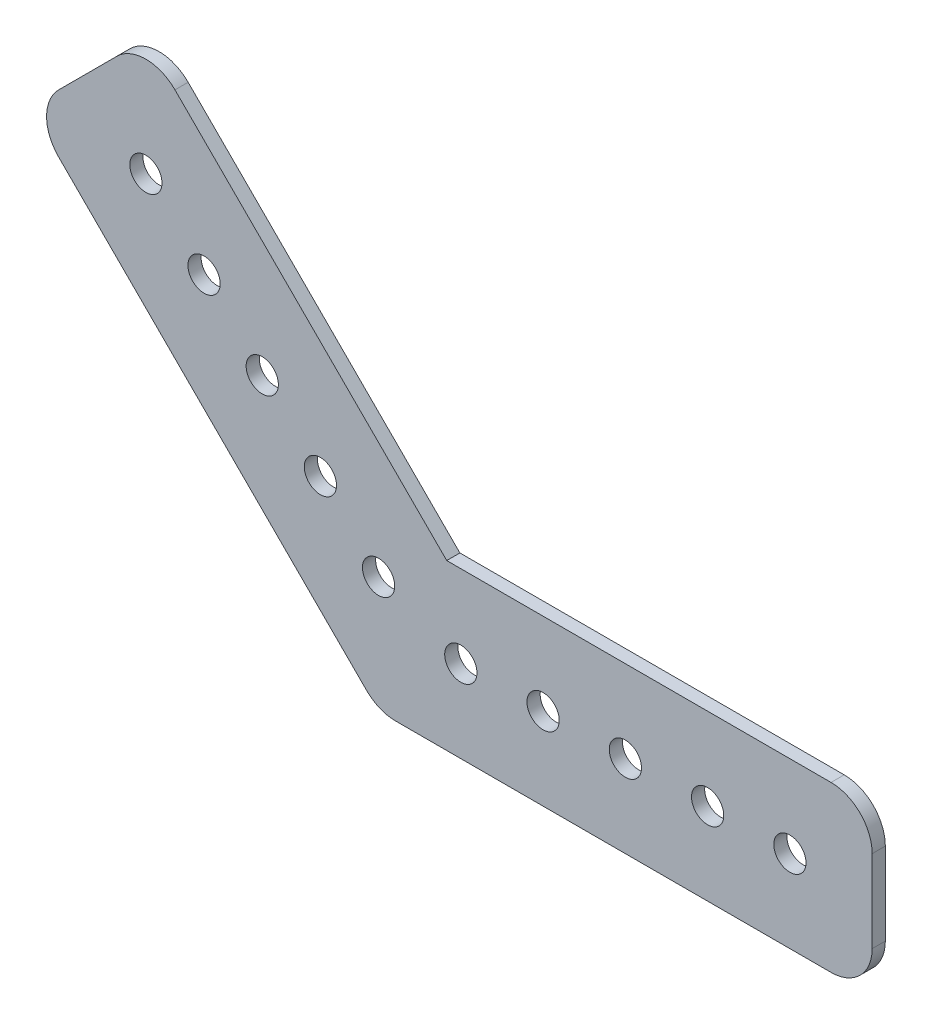
ISO-10303-21;
HEADER;
FILE_DESCRIPTION(('STEP AP214'),'2;1');
FILE_NAME('part.step','',(''),(''),'','','');
FILE_SCHEMA(('AUTOMOTIVE_DESIGN { 1 0 10303 214 1 1 1 1 }'));
ENDSEC;
DATA;
#1=APPLICATION_CONTEXT('core data for automotive mechanical design processes');
#2=APPLICATION_PROTOCOL_DEFINITION('international standard','automotive_design',2000,#1);
#3=PRODUCT_CONTEXT('',#1,'mechanical');
#4=PRODUCT('Part','Part','',(#3));
#5=PRODUCT_RELATED_PRODUCT_CATEGORY('part','',(#4));
#6=PRODUCT_DEFINITION_FORMATION('','',#4);
#7=PRODUCT_DEFINITION_CONTEXT('part definition',#1,'design');
#8=PRODUCT_DEFINITION('design','',#6,#7);
#9=PRODUCT_DEFINITION_SHAPE('','',#8);
#10=(LENGTH_UNIT() NAMED_UNIT(*) SI_UNIT(.MILLI.,.METRE.));
#11=(NAMED_UNIT(*) PLANE_ANGLE_UNIT() SI_UNIT($,.RADIAN.));
#12=(NAMED_UNIT(*) SI_UNIT($,.STERADIAN.) SOLID_ANGLE_UNIT());
#13=UNCERTAINTY_MEASURE_WITH_UNIT(LENGTH_MEASURE(1.E-05),#10,'distance_accuracy_value','');
#14=(GEOMETRIC_REPRESENTATION_CONTEXT(3) GLOBAL_UNCERTAINTY_ASSIGNED_CONTEXT((#13)) GLOBAL_UNIT_ASSIGNED_CONTEXT((#10,
#11,#12)) REPRESENTATION_CONTEXT('',''));
#15=CARTESIAN_POINT('',(0.,0.,0.));
#16=DIRECTION('',(0.,0.,1.));
#17=DIRECTION('',(1.,0.,0.));
#18=AXIS2_PLACEMENT_3D('',#15,#16,#17);
#19=CARTESIAN_POINT('',(-65.2629651905812,26.4043377690454,2.032));
#20=DIRECTION('',(0.,0.,1.));
#21=DIRECTION('',(1.,0.,0.));
#22=AXIS2_PLACEMENT_3D('',#19,#20,#21);
#23=PLANE('',#22);
#24=CARTESIAN_POINT('',(-112.121024484277,53.8815367264149,2.03200000000001));
#25=DIRECTION('',(0.,0.,1.));
#26=DIRECTION('',(1.,0.,0.));
#27=AXIS2_PLACEMENT_3D('',#24,#25,#26);
#28=CIRCLE('',#27,2.4892);
#29=CARTESIAN_POINT('',(-109.631824484277,53.8815367264149,2.03200000000001));
#30=VERTEX_POINT('',#29);
#31=EDGE_CURVE('E216',#30,#30,#28,.F.);
#32=ORIENTED_EDGE('',*,*,#31,.T.);
#33=EDGE_LOOP('',(#32));
#34=FACE_BOUND('',#33,.T.);
#35=CARTESIAN_POINT('',(-94.1605122421384,35.9210244842765,2.03200000000001));
#36=DIRECTION('',(0.,0.,1.));
#37=DIRECTION('',(1.,0.,0.));
#38=AXIS2_PLACEMENT_3D('',#35,#36,#37);
#39=CIRCLE('',#38,2.4892);
#40=CARTESIAN_POINT('',(-91.6713122421384,35.9210244842765,2.03200000000001));
#41=VERTEX_POINT('',#40);
#42=EDGE_CURVE('E213',#41,#41,#39,.F.);
#43=ORIENTED_EDGE('',*,*,#42,.T.);
#44=EDGE_LOOP('',(#43));
#45=FACE_BOUND('',#44,.T.);
#46=CARTESIAN_POINT('',(-76.2,17.9605122421383,2.03200000000001));
#47=DIRECTION('',(0.,0.,1.));
#48=DIRECTION('',(1.,0.,0.));
#49=AXIS2_PLACEMENT_3D('',#46,#47,#48);
#50=CIRCLE('',#49,2.4892);
#51=CARTESIAN_POINT('',(-73.7108,17.9605122421383,2.03200000000001));
#52=VERTEX_POINT('',#51);
#53=EDGE_CURVE('E210',#52,#52,#50,.F.);
#54=ORIENTED_EDGE('',*,*,#53,.T.);
#55=EDGE_LOOP('',(#54));
#56=FACE_BOUND('',#55,.T.);
#57=CARTESIAN_POINT('',(-25.4,12.7,2.03200000000001));
#58=DIRECTION('',(0.,0.,1.));
#59=DIRECTION('',(1.,0.,0.));
#60=AXIS2_PLACEMENT_3D('',#57,#58,#59);
#61=CIRCLE('',#60,2.4892);
#62=CARTESIAN_POINT('',(-22.9108,12.7,2.03200000000001));
#63=VERTEX_POINT('',#62);
#64=EDGE_CURVE('E207',#63,#63,#61,.F.);
#65=ORIENTED_EDGE('',*,*,#64,.T.);
#66=EDGE_LOOP('',(#65));
#67=FACE_BOUND('',#66,.T.);
#68=CARTESIAN_POINT('',(-50.8,12.7,2.03200000000001));
#69=DIRECTION('',(0.,0.,1.));
#70=DIRECTION('',(1.,0.,0.));
#71=AXIS2_PLACEMENT_3D('',#68,#69,#70);
#72=CIRCLE('',#71,2.4892);
#73=CARTESIAN_POINT('',(-48.3108,12.7,2.03200000000001));
#74=VERTEX_POINT('',#73);
#75=EDGE_CURVE('E204',#74,#74,#72,.F.);
#76=ORIENTED_EDGE('',*,*,#75,.T.);
#77=EDGE_LOOP('',(#76));
#78=FACE_BOUND('',#77,.T.);
#79=CARTESIAN_POINT('',(-63.5,12.7,2.03200000000001));
#80=DIRECTION('',(0.,0.,1.));
#81=DIRECTION('',(1.,0.,0.));
#82=AXIS2_PLACEMENT_3D('',#79,#80,#81);
#83=CIRCLE('',#82,2.4892);
#84=CARTESIAN_POINT('',(-61.0108,12.7,2.03200000000001));
#85=VERTEX_POINT('',#84);
#86=EDGE_CURVE('E201',#85,#85,#83,.F.);
#87=ORIENTED_EDGE('',*,*,#86,.T.);
#88=EDGE_LOOP('',(#87));
#89=FACE_BOUND('',#88,.T.);
#90=CARTESIAN_POINT('',(-38.1,12.7,2.03200000000001));
#91=DIRECTION('',(0.,0.,1.));
#92=DIRECTION('',(1.,0.,0.));
#93=AXIS2_PLACEMENT_3D('',#90,#91,#92);
#94=CIRCLE('',#93,2.4892);
#95=CARTESIAN_POINT('',(-35.6108,12.7,2.03200000000001));
#96=VERTEX_POINT('',#95);
#97=EDGE_CURVE('E198',#96,#96,#94,.F.);
#98=ORIENTED_EDGE('',*,*,#97,.T.);
#99=EDGE_LOOP('',(#98));
#100=FACE_BOUND('',#99,.T.);
#101=CARTESIAN_POINT('',(-12.7,12.7,2.03200000000001));
#102=DIRECTION('',(0.,0.,1.));
#103=DIRECTION('',(1.,0.,0.));
#104=AXIS2_PLACEMENT_3D('',#101,#102,#103);
#105=CIRCLE('',#104,2.4892);
#106=CARTESIAN_POINT('',(-10.2108,12.7,2.03200000000001));
#107=VERTEX_POINT('',#106);
#108=EDGE_CURVE('E195',#107,#107,#105,.F.);
#109=ORIENTED_EDGE('',*,*,#108,.T.);
#110=EDGE_LOOP('',(#109));
#111=FACE_BOUND('',#110,.T.);
#112=CARTESIAN_POINT('',(-85.1802561210693,26.9407683632074,2.03200000000001));
#113=DIRECTION('',(0.,0.,1.));
#114=DIRECTION('',(1.,0.,0.));
#115=AXIS2_PLACEMENT_3D('',#112,#113,#114);
#116=CIRCLE('',#115,2.4892);
#117=CARTESIAN_POINT('',(-82.6910561210693,26.9407683632074,2.03200000000001));
#118=VERTEX_POINT('',#117);
#119=EDGE_CURVE('E192',#118,#118,#116,.F.);
#120=ORIENTED_EDGE('',*,*,#119,.T.);
#121=EDGE_LOOP('',(#120));
#122=FACE_BOUND('',#121,.T.);
#123=CARTESIAN_POINT('',(-103.140768363207,44.9012806053458,2.03200000000001));
#124=DIRECTION('',(0.,0.,1.));
#125=DIRECTION('',(1.,0.,0.));
#126=AXIS2_PLACEMENT_3D('',#123,#124,#125);
#127=CIRCLE('',#126,2.4892);
#128=CARTESIAN_POINT('',(-100.651568363207,44.9012806053458,2.03200000000001));
#129=VERTEX_POINT('',#128);
#130=EDGE_CURVE('E189',#129,#129,#127,.F.);
#131=ORIENTED_EDGE('',*,*,#130,.T.);
#132=EDGE_LOOP('',(#131));
#133=FACE_BOUND('',#132,.T.);
#134=DIRECTION('',(-1.,0.,0.));
#135=VECTOR('',#134,1.);
#136=CARTESIAN_POINT('',(0.,25.4,2.032));
#137=LINE('',#136,#135);
#138=CARTESIAN_POINT('',(-65.6789755157235,25.4,2.032));
#139=VERTEX_POINT('',#138);
#140=CARTESIAN_POINT('',(-6.35,25.4,2.032));
#141=VERTEX_POINT('',#140);
#142=EDGE_CURVE('E125',#139,#141,#137,.F.);
#143=ORIENTED_EDGE('',*,*,#142,.F.);
#144=DIRECTION('',(-0.707106781186548,0.707106781186547,0.));
#145=VECTOR('',#144,1.);
#146=CARTESIAN_POINT('',(-65.6789755157235,25.4,2.032));
#147=LINE('',#146,#145);
#148=CARTESIAN_POINT('',(-107.630896423742,67.3519209080186,2.032));
#149=VERTEX_POINT('',#148);
#150=EDGE_CURVE('E121',#149,#139,#147,.F.);
#151=ORIENTED_EDGE('',*,*,#150,.F.);
#152=CARTESIAN_POINT('',(-112.121024484277,62.8617928474842,2.032));
#153=DIRECTION('',(0.,0.,1.));
#154=DIRECTION('',(1.,0.,0.));
#155=AXIS2_PLACEMENT_3D('',#152,#153,#154);
#156=CIRCLE('',#155,6.35);
#157=CARTESIAN_POINT('',(-116.611152544811,67.3519209080187,2.032));
#158=VERTEX_POINT('',#157);
#159=EDGE_CURVE('E108',#158,#149,#156,.F.);
#160=ORIENTED_EDGE('',*,*,#159,.F.);
#161=DIRECTION('',(-0.707106781186547,-0.707106781186548,0.));
#162=VECTOR('',#161,1.);
#163=CARTESIAN_POINT('',(-112.121024484277,71.8420489685532,2.032));
#164=LINE('',#163,#162);
#165=CARTESIAN_POINT('',(-125.59140866588,58.3716647869495,2.032));
#166=VERTEX_POINT('',#165);
#167=EDGE_CURVE('E104',#166,#158,#164,.F.);
#168=ORIENTED_EDGE('',*,*,#167,.F.);
#169=CARTESIAN_POINT('',(-121.101280605346,53.8815367264149,2.032));
#170=DIRECTION('',(0.,0.,1.));
#171=DIRECTION('',(1.,0.,0.));
#172=AXIS2_PLACEMENT_3D('',#169,#170,#171);
#173=CIRCLE('',#172,6.35);
#174=CARTESIAN_POINT('',(-125.59140866588,49.3914086658803,2.032));
#175=VERTEX_POINT('',#174);
#176=EDGE_CURVE('E18',#175,#166,#173,.F.);
#177=ORIENTED_EDGE('',*,*,#176,.F.);
#178=DIRECTION('',(0.707106781186548,-0.707106781186547,0.));
#179=VECTOR('',#178,1.);
#180=CARTESIAN_POINT('',(-130.081536726415,53.8815367264149,2.032));
#181=LINE('',#180,#179);
#182=CARTESIAN_POINT('',(-78.0598719394654,1.85987193946542,2.032));
#183=VERTEX_POINT('',#182);
#184=EDGE_CURVE('E117',#183,#175,#181,.F.);
#185=ORIENTED_EDGE('',*,*,#184,.F.);
#186=CARTESIAN_POINT('',(-73.5697438789309,6.35,2.032));
#187=DIRECTION('',(0.,0.,1.));
#188=DIRECTION('',(1.,0.,0.));
#189=AXIS2_PLACEMENT_3D('',#186,#187,#188);
#190=CIRCLE('',#189,6.35);
#191=CARTESIAN_POINT('',(-73.5697438789309,0.,2.032));
#192=VERTEX_POINT('',#191);
#193=EDGE_CURVE('E143',#192,#183,#190,.F.);
#194=ORIENTED_EDGE('',*,*,#193,.F.);
#195=DIRECTION('',(1.,0.,0.));
#196=VECTOR('',#195,1.);
#197=CARTESIAN_POINT('',(-76.2,0.,2.032));
#198=LINE('',#197,#196);
#199=CARTESIAN_POINT('',(-6.35,0.,2.032));
#200=VERTEX_POINT('',#199);
#201=EDGE_CURVE('E138',#200,#192,#198,.F.);
#202=ORIENTED_EDGE('',*,*,#201,.F.);
#203=CARTESIAN_POINT('',(-6.35,6.35,2.032));
#204=DIRECTION('',(0.,0.,1.));
#205=DIRECTION('',(1.,0.,0.));
#206=AXIS2_PLACEMENT_3D('',#203,#204,#205);
#207=CIRCLE('',#206,6.35);
#208=CARTESIAN_POINT('',(0.,6.35,2.032));
#209=VERTEX_POINT('',#208);
#210=EDGE_CURVE('E141',#209,#200,#207,.F.);
#211=ORIENTED_EDGE('',*,*,#210,.F.);
#212=DIRECTION('',(0.,1.,0.));
#213=VECTOR('',#212,1.);
#214=CARTESIAN_POINT('',(0.,0.,2.032));
#215=LINE('',#214,#213);
#216=CARTESIAN_POINT('',(0.,19.05,2.032));
#217=VERTEX_POINT('',#216);
#218=EDGE_CURVE('E133',#217,#209,#215,.F.);
#219=ORIENTED_EDGE('',*,*,#218,.F.);
#220=CARTESIAN_POINT('',(-6.35,19.05,2.032));
#221=DIRECTION('',(0.,0.,1.));
#222=DIRECTION('',(1.,0.,0.));
#223=AXIS2_PLACEMENT_3D('',#220,#221,#222);
#224=CIRCLE('',#223,6.35);
#225=EDGE_CURVE('E136',#141,#217,#224,.F.);
#226=ORIENTED_EDGE('',*,*,#225,.F.);
#227=EDGE_LOOP('',(#143,#151,#160,#168,#177,#185,#194,#202,#211,#219,#226));
#228=FACE_BOUND('',#227,.T.);
#229=ADVANCED_FACE('F15',(#34,#45,#56,#67,#78,#89,#100,#111,#122,#133,#228),#23,.T.);
#230=CARTESIAN_POINT('',(-112.121024484277,71.8420489685532,0.));
#231=DIRECTION('',(-0.707106781186548,0.707106781186547,0.));
#232=DIRECTION('',(-0.707106781186547,-0.707106781186548,0.));
#233=AXIS2_PLACEMENT_3D('',#230,#231,#232);
#234=PLANE('',#233);
#235=DIRECTION('',(0.,0.,1.));
#236=VECTOR('',#235,1.);
#237=CARTESIAN_POINT('',(-125.59140866588,58.3716647869494,0.));
#238=LINE('',#237,#236);
#239=CARTESIAN_POINT('',(-125.59140866588,58.3716647869495,0.));
#240=VERTEX_POINT('',#239);
#241=EDGE_CURVE('E101',#166,#240,#238,.F.);
#242=ORIENTED_EDGE('',*,*,#241,.F.);
#243=ORIENTED_EDGE('',*,*,#167,.T.);
#244=DIRECTION('',(0.,0.,1.));
#245=VECTOR('',#244,1.);
#246=CARTESIAN_POINT('',(-116.611152544811,67.3519209080188,0.));
#247=LINE('',#246,#245);
#248=CARTESIAN_POINT('',(-116.611152544811,67.3519209080187,0.));
#249=VERTEX_POINT('',#248);
#250=EDGE_CURVE('E219',#249,#158,#247,.T.);
#251=ORIENTED_EDGE('',*,*,#250,.F.);
#252=DIRECTION('',(-0.707106781186558,-0.707106781186537,0.));
#253=VECTOR('',#252,1.);
#254=CARTESIAN_POINT('',(-116.611152544811,67.3519209080186,0.));
#255=LINE('',#254,#253);
#256=EDGE_CURVE('E115',#249,#240,#255,.T.);
#257=ORIENTED_EDGE('',*,*,#256,.T.);
#258=EDGE_LOOP('',(#242,#243,#251,#257));
#259=FACE_BOUND('',#258,.T.);
#260=ADVANCED_FACE('F114',(#259),#234,.T.);
#261=CARTESIAN_POINT('',(-121.101280605346,53.8815367264149,0.));
#262=DIRECTION('',(0.,0.,1.));
#263=DIRECTION('',(1.,0.,0.));
#264=AXIS2_PLACEMENT_3D('',#261,#262,#263);
#265=CYLINDRICAL_SURFACE('',#264,6.35);
#266=CARTESIAN_POINT('',(-121.101280605346,53.8815367264149,0.));
#267=DIRECTION('',(0.,0.,1.));
#268=DIRECTION('',(1.,0.,0.));
#269=AXIS2_PLACEMENT_3D('',#266,#267,#268);
#270=CIRCLE('',#269,6.35);
#271=CARTESIAN_POINT('',(-125.59140866588,49.3914086658803,0.));
#272=VERTEX_POINT('',#271);
#273=EDGE_CURVE('E187',#240,#272,#270,.T.);
#274=ORIENTED_EDGE('',*,*,#273,.T.);
#275=DIRECTION('',(0.,0.,1.));
#276=VECTOR('',#275,1.);
#277=CARTESIAN_POINT('',(-125.59140866588,49.3914086658803,0.));
#278=LINE('',#277,#276);
#279=EDGE_CURVE('E103',#175,#272,#278,.F.);
#280=ORIENTED_EDGE('',*,*,#279,.F.);
#281=ORIENTED_EDGE('',*,*,#176,.T.);
#282=ORIENTED_EDGE('',*,*,#241,.T.);
#283=EDGE_LOOP('',(#274,#280,#281,#282));
#284=FACE_BOUND('',#283,.T.);
#285=ADVANCED_FACE('F99',(#284),#265,.T.);
#286=CARTESIAN_POINT('',(-130.081536726415,53.8815367264149,0.));
#287=DIRECTION('',(-0.707106781186547,-0.707106781186548,0.));
#288=DIRECTION('',(0.707106781186548,-0.707106781186547,0.));
#289=AXIS2_PLACEMENT_3D('',#286,#287,#288);
#290=PLANE('',#289);
#291=DIRECTION('',(0.,0.,1.));
#292=VECTOR('',#291,1.);
#293=CARTESIAN_POINT('',(-78.0598719394654,1.85987193946534,0.));
#294=LINE('',#293,#292);
#295=CARTESIAN_POINT('',(-78.0598719394654,1.85987193946541,0.));
#296=VERTEX_POINT('',#295);
#297=EDGE_CURVE('E224',#183,#296,#294,.F.);
#298=ORIENTED_EDGE('',*,*,#297,.F.);
#299=ORIENTED_EDGE('',*,*,#184,.T.);
#300=ORIENTED_EDGE('',*,*,#279,.T.);
#301=DIRECTION('',(0.70710678118655,-0.707106781186545,0.));
#302=VECTOR('',#301,1.);
#303=CARTESIAN_POINT('',(-125.59140866588,49.3914086658802,0.));
#304=LINE('',#303,#302);
#305=EDGE_CURVE('E186',#272,#296,#304,.T.);
#306=ORIENTED_EDGE('',*,*,#305,.T.);
#307=EDGE_LOOP('',(#298,#299,#300,#306));
#308=FACE_BOUND('',#307,.T.);
#309=ADVANCED_FACE('F284',(#308),#290,.T.);
#310=CARTESIAN_POINT('',(-73.5697438789309,6.35,0.));
#311=DIRECTION('',(0.,0.,1.));
#312=DIRECTION('',(1.,0.,0.));
#313=AXIS2_PLACEMENT_3D('',#310,#311,#312);
#314=CYLINDRICAL_SURFACE('',#313,6.35);
#315=CARTESIAN_POINT('',(-73.5697438789309,6.35,0.));
#316=DIRECTION('',(0.,0.,1.));
#317=DIRECTION('',(1.,0.,0.));
#318=AXIS2_PLACEMENT_3D('',#315,#316,#317);
#319=CIRCLE('',#318,6.35);
#320=CARTESIAN_POINT('',(-73.5697438789309,0.,0.));
#321=VERTEX_POINT('',#320);
#322=EDGE_CURVE('E183',#296,#321,#319,.T.);
#323=ORIENTED_EDGE('',*,*,#322,.T.);
#324=DIRECTION('',(0.,0.,1.));
#325=VECTOR('',#324,1.);
#326=CARTESIAN_POINT('',(-73.5697438789309,0.,0.));
#327=LINE('',#326,#325);
#328=EDGE_CURVE('E142',#192,#321,#327,.F.);
#329=ORIENTED_EDGE('',*,*,#328,.F.);
#330=ORIENTED_EDGE('',*,*,#193,.T.);
#331=ORIENTED_EDGE('',*,*,#297,.T.);
#332=EDGE_LOOP('',(#323,#329,#330,#331));
#333=FACE_BOUND('',#332,.T.);
#334=ADVANCED_FACE('F281',(#333),#314,.T.);
#335=CARTESIAN_POINT('',(-76.2,0.,0.));
#336=DIRECTION('',(0.,-1.,0.));
#337=DIRECTION('',(1.,0.,0.));
#338=AXIS2_PLACEMENT_3D('',#335,#336,#337);
#339=PLANE('',#338);
#340=DIRECTION('',(0.,0.,1.));
#341=VECTOR('',#340,1.);
#342=CARTESIAN_POINT('',(-6.35,0.,0.));
#343=LINE('',#342,#341);
#344=CARTESIAN_POINT('',(-6.35,0.,0.));
#345=VERTEX_POINT('',#344);
#346=EDGE_CURVE('E223',#200,#345,#343,.F.);
#347=ORIENTED_EDGE('',*,*,#346,.F.);
#348=ORIENTED_EDGE('',*,*,#201,.T.);
#349=ORIENTED_EDGE('',*,*,#328,.T.);
#350=DIRECTION('',(1.,0.,0.));
#351=VECTOR('',#350,1.);
#352=CARTESIAN_POINT('',(-65.2629651905812,0.,0.));
#353=LINE('',#352,#351);
#354=EDGE_CURVE('E182',#321,#345,#353,.T.);
#355=ORIENTED_EDGE('',*,*,#354,.T.);
#356=EDGE_LOOP('',(#347,#348,#349,#355));
#357=FACE_BOUND('',#356,.T.);
#358=ADVANCED_FACE('F280',(#357),#339,.T.);
#359=CARTESIAN_POINT('',(-6.35,6.35,0.));
#360=DIRECTION('',(0.,0.,1.));
#361=DIRECTION('',(1.,0.,0.));
#362=AXIS2_PLACEMENT_3D('',#359,#360,#361);
#363=CYLINDRICAL_SURFACE('',#362,6.35);
#364=CARTESIAN_POINT('',(-6.35,6.35,0.));
#365=DIRECTION('',(0.,0.,1.));
#366=DIRECTION('',(1.,0.,0.));
#367=AXIS2_PLACEMENT_3D('',#364,#365,#366);
#368=CIRCLE('',#367,6.35);
#369=CARTESIAN_POINT('',(0.,6.35,0.));
#370=VERTEX_POINT('',#369);
#371=EDGE_CURVE('E179',#345,#370,#368,.T.);
#372=ORIENTED_EDGE('',*,*,#371,.T.);
#373=DIRECTION('',(0.,0.,1.));
#374=VECTOR('',#373,1.);
#375=CARTESIAN_POINT('',(0.,6.35,0.));
#376=LINE('',#375,#374);
#377=EDGE_CURVE('E137',#209,#370,#376,.F.);
#378=ORIENTED_EDGE('',*,*,#377,.F.);
#379=ORIENTED_EDGE('',*,*,#210,.T.);
#380=ORIENTED_EDGE('',*,*,#346,.T.);
#381=EDGE_LOOP('',(#372,#378,#379,#380));
#382=FACE_BOUND('',#381,.T.);
#383=ADVANCED_FACE('F275',(#382),#363,.T.);
#384=CARTESIAN_POINT('',(0.,0.,0.));
#385=DIRECTION('',(1.,0.,0.));
#386=DIRECTION('',(0.,1.,0.));
#387=AXIS2_PLACEMENT_3D('',#384,#385,#386);
#388=PLANE('',#387);
#389=DIRECTION('',(0.,0.,1.));
#390=VECTOR('',#389,1.);
#391=CARTESIAN_POINT('',(0.,19.05,0.));
#392=LINE('',#391,#390);
#393=CARTESIAN_POINT('',(0.,19.05,0.));
#394=VERTEX_POINT('',#393);
#395=EDGE_CURVE('E222',#217,#394,#392,.F.);
#396=ORIENTED_EDGE('',*,*,#395,.F.);
#397=ORIENTED_EDGE('',*,*,#218,.T.);
#398=ORIENTED_EDGE('',*,*,#377,.T.);
#399=DIRECTION('',(0.,1.,0.));
#400=VECTOR('',#399,1.);
#401=CARTESIAN_POINT('',(0.,26.4043377690454,0.));
#402=LINE('',#401,#400);
#403=EDGE_CURVE('E178',#370,#394,#402,.T.);
#404=ORIENTED_EDGE('',*,*,#403,.T.);
#405=EDGE_LOOP('',(#396,#397,#398,#404));
#406=FACE_BOUND('',#405,.T.);
#407=ADVANCED_FACE('F272',(#406),#388,.T.);
#408=CARTESIAN_POINT('',(-6.35,19.05,0.));
#409=DIRECTION('',(0.,0.,1.));
#410=DIRECTION('',(1.,0.,0.));
#411=AXIS2_PLACEMENT_3D('',#408,#409,#410);
#412=CYLINDRICAL_SURFACE('',#411,6.35);
#413=CARTESIAN_POINT('',(-6.35,19.05,0.));
#414=DIRECTION('',(0.,0.,1.));
#415=DIRECTION('',(1.,0.,0.));
#416=AXIS2_PLACEMENT_3D('',#413,#414,#415);
#417=CIRCLE('',#416,6.35);
#418=CARTESIAN_POINT('',(-6.35,25.4,0.));
#419=VERTEX_POINT('',#418);
#420=EDGE_CURVE('E174',#394,#419,#417,.T.);
#421=ORIENTED_EDGE('',*,*,#420,.T.);
#422=DIRECTION('',(0.,0.,1.));
#423=VECTOR('',#422,1.);
#424=CARTESIAN_POINT('',(-6.35,25.4,0.));
#425=LINE('',#424,#423);
#426=EDGE_CURVE('E130',#141,#419,#425,.F.);
#427=ORIENTED_EDGE('',*,*,#426,.F.);
#428=ORIENTED_EDGE('',*,*,#225,.T.);
#429=ORIENTED_EDGE('',*,*,#395,.T.);
#430=EDGE_LOOP('',(#421,#427,#428,#429));
#431=FACE_BOUND('',#430,.T.);
#432=ADVANCED_FACE('F266',(#431),#412,.T.);
#433=CARTESIAN_POINT('',(0.,25.4,0.));
#434=DIRECTION('',(0.,1.,0.));
#435=DIRECTION('',(-1.,0.,0.));
#436=AXIS2_PLACEMENT_3D('',#433,#434,#435);
#437=PLANE('',#436);
#438=DIRECTION('',(0.,0.,1.));
#439=VECTOR('',#438,1.);
#440=CARTESIAN_POINT('',(-65.6789755157235,25.4,0.));
#441=LINE('',#440,#439);
#442=CARTESIAN_POINT('',(-65.6789755157235,25.4,0.));
#443=VERTEX_POINT('',#442);
#444=EDGE_CURVE('E124',#139,#443,#441,.F.);
#445=ORIENTED_EDGE('',*,*,#444,.F.);
#446=ORIENTED_EDGE('',*,*,#142,.T.);
#447=ORIENTED_EDGE('',*,*,#426,.T.);
#448=DIRECTION('',(1.,0.,0.));
#449=VECTOR('',#448,1.);
#450=CARTESIAN_POINT('',(-65.2629651905812,25.4,0.));
#451=LINE('',#450,#449);
#452=EDGE_CURVE('E177',#419,#443,#451,.F.);
#453=ORIENTED_EDGE('',*,*,#452,.T.);
#454=EDGE_LOOP('',(#445,#446,#447,#453));
#455=FACE_BOUND('',#454,.T.);
#456=ADVANCED_FACE('F263',(#455),#437,.T.);
#457=CARTESIAN_POINT('',(-65.6789755157235,25.4,0.));
#458=DIRECTION('',(0.707106781186547,0.707106781186548,0.));
#459=DIRECTION('',(-0.707106781186548,0.707106781186547,0.));
#460=AXIS2_PLACEMENT_3D('',#457,#458,#459);
#461=PLANE('',#460);
#462=ORIENTED_EDGE('',*,*,#444,.T.);
#463=DIRECTION('',(-0.707106781186547,0.707106781186548,0.));
#464=VECTOR('',#463,1.);
#465=CARTESIAN_POINT('',(-65.6789755157235,25.4,0.));
#466=LINE('',#465,#464);
#467=CARTESIAN_POINT('',(-107.630896423742,67.3519209080186,0.));
#468=VERTEX_POINT('',#467);
#469=EDGE_CURVE('E173',#443,#468,#466,.T.);
#470=ORIENTED_EDGE('',*,*,#469,.T.);
#471=DIRECTION('',(0.,0.,1.));
#472=VECTOR('',#471,1.);
#473=CARTESIAN_POINT('',(-107.630896423742,67.3519209080186,0.));
#474=LINE('',#473,#472);
#475=EDGE_CURVE('E33',#149,#468,#474,.F.);
#476=ORIENTED_EDGE('',*,*,#475,.F.);
#477=ORIENTED_EDGE('',*,*,#150,.T.);
#478=EDGE_LOOP('',(#462,#470,#476,#477));
#479=FACE_BOUND('',#478,.T.);
#480=ADVANCED_FACE('F256',(#479),#461,.T.);
#481=CARTESIAN_POINT('',(-112.121024484277,62.8617928474842,0.));
#482=DIRECTION('',(0.,0.,1.));
#483=DIRECTION('',(1.,0.,0.));
#484=AXIS2_PLACEMENT_3D('',#481,#482,#483);
#485=CYLINDRICAL_SURFACE('',#484,6.35);
#486=CARTESIAN_POINT('',(-112.121024484277,62.8617928474842,0.));
#487=DIRECTION('',(0.,0.,1.));
#488=DIRECTION('',(1.,0.,0.));
#489=AXIS2_PLACEMENT_3D('',#486,#487,#488);
#490=CIRCLE('',#489,6.35);
#491=EDGE_CURVE('E171',#468,#249,#490,.T.);
#492=ORIENTED_EDGE('',*,*,#491,.T.);
#493=ORIENTED_EDGE('',*,*,#250,.T.);
#494=ORIENTED_EDGE('',*,*,#159,.T.);
#495=ORIENTED_EDGE('',*,*,#475,.T.);
#496=EDGE_LOOP('',(#492,#493,#494,#495));
#497=FACE_BOUND('',#496,.T.);
#498=ADVANCED_FACE('F341',(#497),#485,.T.);
#499=CARTESIAN_POINT('',(-112.121024484277,53.8815367264149,148.615662771814));
#500=DIRECTION('',(0.,0.,1.));
#501=DIRECTION('',(1.,0.,0.));
#502=AXIS2_PLACEMENT_3D('',#499,#500,#501);
#503=CYLINDRICAL_SURFACE('',#502,2.4892);
#504=CARTESIAN_POINT('',(-112.121024484277,53.8815367264149,0.));
#505=DIRECTION('',(0.,0.,1.));
#506=DIRECTION('',(1.,0.,0.));
#507=AXIS2_PLACEMENT_3D('',#504,#505,#506);
#508=CIRCLE('',#507,2.4892);
#509=CARTESIAN_POINT('',(-109.631824484277,53.8815367264149,0.));
#510=VERTEX_POINT('',#509);
#511=EDGE_CURVE('E168',#510,#510,#508,.F.);
#512=ORIENTED_EDGE('',*,*,#511,.T.);
#513=EDGE_LOOP('',(#512));
#514=FACE_BOUND('',#513,.T.);
#515=ORIENTED_EDGE('',*,*,#31,.F.);
#516=EDGE_LOOP('',(#515));
#517=FACE_BOUND('',#516,.T.);
#518=ADVANCED_FACE('F337',(#514,#517),#503,.F.);
#519=CARTESIAN_POINT('',(-94.1605122421384,35.9210244842765,148.615662771814));
#520=DIRECTION('',(0.,0.,1.));
#521=DIRECTION('',(1.,0.,0.));
#522=AXIS2_PLACEMENT_3D('',#519,#520,#521);
#523=CYLINDRICAL_SURFACE('',#522,2.4892);
#524=CARTESIAN_POINT('',(-94.1605122421384,35.9210244842765,0.));
#525=DIRECTION('',(0.,0.,1.));
#526=DIRECTION('',(1.,0.,0.));
#527=AXIS2_PLACEMENT_3D('',#524,#525,#526);
#528=CIRCLE('',#527,2.4892);
#529=CARTESIAN_POINT('',(-91.6713122421384,35.9210244842765,0.));
#530=VERTEX_POINT('',#529);
#531=EDGE_CURVE('E165',#530,#530,#528,.F.);
#532=ORIENTED_EDGE('',*,*,#531,.T.);
#533=EDGE_LOOP('',(#532));
#534=FACE_BOUND('',#533,.T.);
#535=ORIENTED_EDGE('',*,*,#42,.F.);
#536=EDGE_LOOP('',(#535));
#537=FACE_BOUND('',#536,.T.);
#538=ADVANCED_FACE('F333',(#534,#537),#523,.F.);
#539=CARTESIAN_POINT('',(-76.2,17.9605122421383,148.615662771814));
#540=DIRECTION('',(0.,0.,1.));
#541=DIRECTION('',(1.,0.,0.));
#542=AXIS2_PLACEMENT_3D('',#539,#540,#541);
#543=CYLINDRICAL_SURFACE('',#542,2.4892);
#544=CARTESIAN_POINT('',(-76.2,17.9605122421383,0.));
#545=DIRECTION('',(0.,0.,1.));
#546=DIRECTION('',(1.,0.,0.));
#547=AXIS2_PLACEMENT_3D('',#544,#545,#546);
#548=CIRCLE('',#547,2.4892);
#549=CARTESIAN_POINT('',(-73.7108,17.9605122421383,0.));
#550=VERTEX_POINT('',#549);
#551=EDGE_CURVE('E162',#550,#550,#548,.F.);
#552=ORIENTED_EDGE('',*,*,#551,.T.);
#553=EDGE_LOOP('',(#552));
#554=FACE_BOUND('',#553,.T.);
#555=ORIENTED_EDGE('',*,*,#53,.F.);
#556=EDGE_LOOP('',(#555));
#557=FACE_BOUND('',#556,.T.);
#558=ADVANCED_FACE('F329',(#554,#557),#543,.F.);
#559=CARTESIAN_POINT('',(-25.4,12.7,148.615662771814));
#560=DIRECTION('',(0.,0.,1.));
#561=DIRECTION('',(1.,0.,0.));
#562=AXIS2_PLACEMENT_3D('',#559,#560,#561);
#563=CYLINDRICAL_SURFACE('',#562,2.4892);
#564=CARTESIAN_POINT('',(-25.4,12.7,0.));
#565=DIRECTION('',(0.,0.,1.));
#566=DIRECTION('',(1.,0.,0.));
#567=AXIS2_PLACEMENT_3D('',#564,#565,#566);
#568=CIRCLE('',#567,2.4892);
#569=CARTESIAN_POINT('',(-22.9108,12.7,0.));
#570=VERTEX_POINT('',#569);
#571=EDGE_CURVE('E159',#570,#570,#568,.F.);
#572=ORIENTED_EDGE('',*,*,#571,.T.);
#573=EDGE_LOOP('',(#572));
#574=FACE_BOUND('',#573,.T.);
#575=ORIENTED_EDGE('',*,*,#64,.F.);
#576=EDGE_LOOP('',(#575));
#577=FACE_BOUND('',#576,.T.);
#578=ADVANCED_FACE('F325',(#574,#577),#563,.F.);
#579=CARTESIAN_POINT('',(-50.8,12.7,148.615662771814));
#580=DIRECTION('',(0.,0.,1.));
#581=DIRECTION('',(1.,0.,0.));
#582=AXIS2_PLACEMENT_3D('',#579,#580,#581);
#583=CYLINDRICAL_SURFACE('',#582,2.4892);
#584=CARTESIAN_POINT('',(-50.8,12.7,0.));
#585=DIRECTION('',(0.,0.,1.));
#586=DIRECTION('',(1.,0.,0.));
#587=AXIS2_PLACEMENT_3D('',#584,#585,#586);
#588=CIRCLE('',#587,2.4892);
#589=CARTESIAN_POINT('',(-48.3108,12.7,0.));
#590=VERTEX_POINT('',#589);
#591=EDGE_CURVE('E156',#590,#590,#588,.F.);
#592=ORIENTED_EDGE('',*,*,#591,.T.);
#593=EDGE_LOOP('',(#592));
#594=FACE_BOUND('',#593,.T.);
#595=ORIENTED_EDGE('',*,*,#75,.F.);
#596=EDGE_LOOP('',(#595));
#597=FACE_BOUND('',#596,.T.);
#598=ADVANCED_FACE('F321',(#594,#597),#583,.F.);
#599=CARTESIAN_POINT('',(-63.5,12.7,148.615662771814));
#600=DIRECTION('',(0.,0.,1.));
#601=DIRECTION('',(1.,0.,0.));
#602=AXIS2_PLACEMENT_3D('',#599,#600,#601);
#603=CYLINDRICAL_SURFACE('',#602,2.4892);
#604=CARTESIAN_POINT('',(-63.5,12.7,0.));
#605=DIRECTION('',(0.,0.,1.));
#606=DIRECTION('',(1.,0.,0.));
#607=AXIS2_PLACEMENT_3D('',#604,#605,#606);
#608=CIRCLE('',#607,2.4892);
#609=CARTESIAN_POINT('',(-61.0108,12.7,0.));
#610=VERTEX_POINT('',#609);
#611=EDGE_CURVE('E153',#610,#610,#608,.F.);
#612=ORIENTED_EDGE('',*,*,#611,.T.);
#613=EDGE_LOOP('',(#612));
#614=FACE_BOUND('',#613,.T.);
#615=ORIENTED_EDGE('',*,*,#86,.F.);
#616=EDGE_LOOP('',(#615));
#617=FACE_BOUND('',#616,.T.);
#618=ADVANCED_FACE('F317',(#614,#617),#603,.F.);
#619=CARTESIAN_POINT('',(-38.1,12.7,148.615662771814));
#620=DIRECTION('',(0.,0.,1.));
#621=DIRECTION('',(1.,0.,0.));
#622=AXIS2_PLACEMENT_3D('',#619,#620,#621);
#623=CYLINDRICAL_SURFACE('',#622,2.4892);
#624=CARTESIAN_POINT('',(-38.1,12.7,0.));
#625=DIRECTION('',(0.,0.,1.));
#626=DIRECTION('',(1.,0.,0.));
#627=AXIS2_PLACEMENT_3D('',#624,#625,#626);
#628=CIRCLE('',#627,2.4892);
#629=CARTESIAN_POINT('',(-35.6108,12.7,0.));
#630=VERTEX_POINT('',#629);
#631=EDGE_CURVE('E150',#630,#630,#628,.F.);
#632=ORIENTED_EDGE('',*,*,#631,.T.);
#633=EDGE_LOOP('',(#632));
#634=FACE_BOUND('',#633,.T.);
#635=ORIENTED_EDGE('',*,*,#97,.F.);
#636=EDGE_LOOP('',(#635));
#637=FACE_BOUND('',#636,.T.);
#638=ADVANCED_FACE('F313',(#634,#637),#623,.F.);
#639=CARTESIAN_POINT('',(-12.7,12.7,148.615662771814));
#640=DIRECTION('',(0.,0.,1.));
#641=DIRECTION('',(1.,0.,0.));
#642=AXIS2_PLACEMENT_3D('',#639,#640,#641);
#643=CYLINDRICAL_SURFACE('',#642,2.4892);
#644=CARTESIAN_POINT('',(-12.7,12.7,0.));
#645=DIRECTION('',(0.,0.,1.));
#646=DIRECTION('',(1.,0.,0.));
#647=AXIS2_PLACEMENT_3D('',#644,#645,#646);
#648=CIRCLE('',#647,2.4892);
#649=CARTESIAN_POINT('',(-10.2108,12.7,0.));
#650=VERTEX_POINT('',#649);
#651=EDGE_CURVE('E147',#650,#650,#648,.F.);
#652=ORIENTED_EDGE('',*,*,#651,.T.);
#653=EDGE_LOOP('',(#652));
#654=FACE_BOUND('',#653,.T.);
#655=ORIENTED_EDGE('',*,*,#108,.F.);
#656=EDGE_LOOP('',(#655));
#657=FACE_BOUND('',#656,.T.);
#658=ADVANCED_FACE('F309',(#654,#657),#643,.F.);
#659=CARTESIAN_POINT('',(-85.1802561210693,26.9407683632074,148.615662771814));
#660=DIRECTION('',(0.,0.,1.));
#661=DIRECTION('',(1.,0.,0.));
#662=AXIS2_PLACEMENT_3D('',#659,#660,#661);
#663=CYLINDRICAL_SURFACE('',#662,2.4892);
#664=CARTESIAN_POINT('',(-85.1802561210693,26.9407683632074,0.));
#665=DIRECTION('',(0.,0.,1.));
#666=DIRECTION('',(1.,0.,0.));
#667=AXIS2_PLACEMENT_3D('',#664,#665,#666);
#668=CIRCLE('',#667,2.4892);
#669=CARTESIAN_POINT('',(-82.6910561210693,26.9407683632074,0.));
#670=VERTEX_POINT('',#669);
#671=EDGE_CURVE('E24',#670,#670,#668,.F.);
#672=ORIENTED_EDGE('',*,*,#671,.T.);
#673=EDGE_LOOP('',(#672));
#674=FACE_BOUND('',#673,.T.);
#675=ORIENTED_EDGE('',*,*,#119,.F.);
#676=EDGE_LOOP('',(#675));
#677=FACE_BOUND('',#676,.T.);
#678=ADVANCED_FACE('F301',(#674,#677),#663,.F.);
#679=CARTESIAN_POINT('',(-103.140768363207,44.9012806053458,148.615662771814));
#680=DIRECTION('',(0.,0.,1.));
#681=DIRECTION('',(1.,0.,0.));
#682=AXIS2_PLACEMENT_3D('',#679,#680,#681);
#683=CYLINDRICAL_SURFACE('',#682,2.4892);
#684=CARTESIAN_POINT('',(-103.140768363207,44.9012806053458,0.));
#685=DIRECTION('',(0.,0.,1.));
#686=DIRECTION('',(1.,0.,0.));
#687=AXIS2_PLACEMENT_3D('',#684,#685,#686);
#688=CIRCLE('',#687,2.4892);
#689=CARTESIAN_POINT('',(-100.651568363207,44.9012806053458,0.));
#690=VERTEX_POINT('',#689);
#691=EDGE_CURVE('E9',#690,#690,#688,.F.);
#692=ORIENTED_EDGE('',*,*,#691,.T.);
#693=EDGE_LOOP('',(#692));
#694=FACE_BOUND('',#693,.T.);
#695=ORIENTED_EDGE('',*,*,#130,.F.);
#696=EDGE_LOOP('',(#695));
#697=FACE_BOUND('',#696,.T.);
#698=ADVANCED_FACE('F295',(#694,#697),#683,.F.);
#699=CARTESIAN_POINT('',(-65.2629651905812,26.4043377690454,0.));
#700=DIRECTION('',(0.,0.,1.));
#701=DIRECTION('',(1.,0.,0.));
#702=AXIS2_PLACEMENT_3D('',#699,#700,#701);
#703=PLANE('',#702);
#704=ORIENTED_EDGE('',*,*,#691,.F.);
#705=EDGE_LOOP('',(#704));
#706=FACE_BOUND('',#705,.T.);
#707=ORIENTED_EDGE('',*,*,#671,.F.);
#708=EDGE_LOOP('',(#707));
#709=FACE_BOUND('',#708,.T.);
#710=ORIENTED_EDGE('',*,*,#651,.F.);
#711=EDGE_LOOP('',(#710));
#712=FACE_BOUND('',#711,.T.);
#713=ORIENTED_EDGE('',*,*,#631,.F.);
#714=EDGE_LOOP('',(#713));
#715=FACE_BOUND('',#714,.T.);
#716=ORIENTED_EDGE('',*,*,#611,.F.);
#717=EDGE_LOOP('',(#716));
#718=FACE_BOUND('',#717,.T.);
#719=ORIENTED_EDGE('',*,*,#591,.F.);
#720=EDGE_LOOP('',(#719));
#721=FACE_BOUND('',#720,.T.);
#722=ORIENTED_EDGE('',*,*,#571,.F.);
#723=EDGE_LOOP('',(#722));
#724=FACE_BOUND('',#723,.T.);
#725=ORIENTED_EDGE('',*,*,#551,.F.);
#726=EDGE_LOOP('',(#725));
#727=FACE_BOUND('',#726,.T.);
#728=ORIENTED_EDGE('',*,*,#531,.F.);
#729=EDGE_LOOP('',(#728));
#730=FACE_BOUND('',#729,.T.);
#731=ORIENTED_EDGE('',*,*,#511,.F.);
#732=EDGE_LOOP('',(#731));
#733=FACE_BOUND('',#732,.T.);
#734=ORIENTED_EDGE('',*,*,#469,.F.);
#735=ORIENTED_EDGE('',*,*,#452,.F.);
#736=ORIENTED_EDGE('',*,*,#420,.F.);
#737=ORIENTED_EDGE('',*,*,#403,.F.);
#738=ORIENTED_EDGE('',*,*,#371,.F.);
#739=ORIENTED_EDGE('',*,*,#354,.F.);
#740=ORIENTED_EDGE('',*,*,#322,.F.);
#741=ORIENTED_EDGE('',*,*,#305,.F.);
#742=ORIENTED_EDGE('',*,*,#273,.F.);
#743=ORIENTED_EDGE('',*,*,#256,.F.);
#744=ORIENTED_EDGE('',*,*,#491,.F.);
#745=EDGE_LOOP('',(#734,#735,#736,#737,#738,#739,#740,#741,#742,#743,#744));
#746=FACE_BOUND('',#745,.T.);
#747=ADVANCED_FACE('F260',(#706,#709,#712,#715,#718,#721,#724,#727,#730,#733,#746),#703,.F.);
#748=CLOSED_SHELL('',(#229,#260,#285,#309,#334,#358,#383,#407,#432,#456,#480,#498,#518,#538,
#558,#578,#598,#618,#638,#658,#678,#698,#747));
#749=MANIFOLD_SOLID_BREP('B1',#748);
#750=ADVANCED_BREP_SHAPE_REPRESENTATION('',(#18,#749),#14);
#751=SHAPE_DEFINITION_REPRESENTATION(#9,#750);
ENDSEC;
END-ISO-10303-21;
